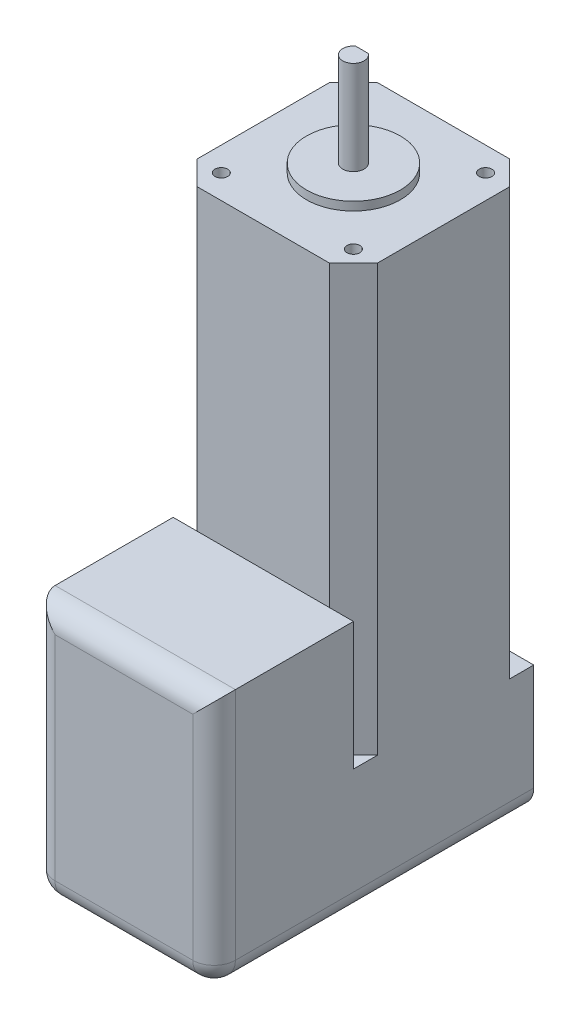
ISO-10303-21;
HEADER;
FILE_DESCRIPTION(('STEP AP214'),'2;1');
FILE_NAME('part.step','',(''),(''),'','','');
FILE_SCHEMA(('AUTOMOTIVE_DESIGN { 1 0 10303 214 1 1 1 1 }'));
ENDSEC;
DATA;
#1=APPLICATION_CONTEXT('core data for automotive mechanical design processes');
#2=APPLICATION_PROTOCOL_DEFINITION('international standard','automotive_design',2000,#1);
#3=PRODUCT_CONTEXT('',#1,'mechanical');
#4=PRODUCT('Part','Part','',(#3));
#5=PRODUCT_RELATED_PRODUCT_CATEGORY('part','',(#4));
#6=PRODUCT_DEFINITION_FORMATION('','',#4);
#7=PRODUCT_DEFINITION_CONTEXT('part definition',#1,'design');
#8=PRODUCT_DEFINITION('design','',#6,#7);
#9=PRODUCT_DEFINITION_SHAPE('','',#8);
#10=(LENGTH_UNIT() NAMED_UNIT(*) SI_UNIT(.MILLI.,.METRE.));
#11=(NAMED_UNIT(*) PLANE_ANGLE_UNIT() SI_UNIT($,.RADIAN.));
#12=(NAMED_UNIT(*) SI_UNIT($,.STERADIAN.) SOLID_ANGLE_UNIT());
#13=UNCERTAINTY_MEASURE_WITH_UNIT(LENGTH_MEASURE(1.E-05),#10,'distance_accuracy_value','');
#14=(GEOMETRIC_REPRESENTATION_CONTEXT(3) GLOBAL_UNCERTAINTY_ASSIGNED_CONTEXT((#13)) GLOBAL_UNIT_ASSIGNED_CONTEXT((#10,
#11,#12)) REPRESENTATION_CONTEXT('',''));
#15=CARTESIAN_POINT('',(0.,0.,0.));
#16=DIRECTION('',(0.,0.,1.));
#17=DIRECTION('',(1.,0.,0.));
#18=AXIS2_PLACEMENT_3D('',#15,#16,#17);
#19=CARTESIAN_POINT('',(5.65,15.,0.));
#20=DIRECTION('',(0.,0.,-1.));
#21=DIRECTION('',(-1.,0.,0.));
#22=AXIS2_PLACEMENT_3D('',#19,#20,#21);
#23=PLANE('',#22);
#24=DIRECTION('',(-1.,0.,0.));
#25=VECTOR('',#24,1.);
#26=CARTESIAN_POINT('',(0.,-55.,0.));
#27=LINE('',#26,#25);
#28=CARTESIAN_POINT('',(36.65,-55.,0.));
#29=VERTEX_POINT('',#28);
#30=CARTESIAN_POINT('',(5.65,-55.,0.));
#31=VERTEX_POINT('',#30);
#32=EDGE_CURVE('E213',#29,#31,#27,.T.);
#33=ORIENTED_EDGE('',*,*,#32,.F.);
#34=DIRECTION('',(0.,-1.,0.));
#35=VECTOR('',#34,1.);
#36=CARTESIAN_POINT('',(36.65,15.,0.));
#37=LINE('',#36,#35);
#38=CARTESIAN_POINT('',(36.65,15.,0.));
#39=VERTEX_POINT('',#38);
#40=EDGE_CURVE('E380',#39,#29,#37,.T.);
#41=ORIENTED_EDGE('',*,*,#40,.F.);
#42=DIRECTION('',(1.,0.,0.));
#43=VECTOR('',#42,1.);
#44=CARTESIAN_POINT('',(5.65,15.,0.));
#45=LINE('',#44,#43);
#46=CARTESIAN_POINT('',(5.65,15.,0.));
#47=VERTEX_POINT('',#46);
#48=EDGE_CURVE('E353',#47,#39,#45,.T.);
#49=ORIENTED_EDGE('',*,*,#48,.F.);
#50=DIRECTION('',(0.,-1.,0.));
#51=VECTOR('',#50,1.);
#52=CARTESIAN_POINT('',(5.65,15.,0.));
#53=LINE('',#52,#51);
#54=EDGE_CURVE('E384',#47,#31,#53,.T.);
#55=ORIENTED_EDGE('',*,*,#54,.T.);
#56=EDGE_LOOP('',(#33,#41,#49,#55));
#57=FACE_BOUND('',#56,.T.);
#58=ADVANCED_FACE('F41',(#57),#23,.F.);
#59=CARTESIAN_POINT('',(0.,-85.,0.));
#60=DIRECTION('',(0.,1.,0.));
#61=DIRECTION('',(0.,0.,1.));
#62=AXIS2_PLACEMENT_3D('',#59,#60,#61);
#63=PLANE('',#62);
#64=DIRECTION('',(0.,0.,-1.));
#65=VECTOR('',#64,1.);
#66=CARTESIAN_POINT('',(0.,-85.,32.7));
#67=LINE('',#66,#65);
#68=CARTESIAN_POINT('',(0.,-85.,0.));
#69=VERTEX_POINT('',#68);
#70=CARTESIAN_POINT('',(0.,-85.,-5.65));
#71=VERTEX_POINT('',#70);
#72=EDGE_CURVE('E253',#69,#71,#67,.T.);
#73=ORIENTED_EDGE('',*,*,#72,.F.);
#74=DIRECTION('',(1.,0.,0.));
#75=VECTOR('',#74,1.);
#76=CARTESIAN_POINT('',(0.,-85.,0.));
#77=LINE('',#76,#75);
#78=CARTESIAN_POINT('',(5.65,-85.,0.));
#79=VERTEX_POINT('',#78);
#80=EDGE_CURVE('E226',#69,#79,#77,.T.);
#81=ORIENTED_EDGE('',*,*,#80,.T.);
#82=DIRECTION('',(-0.707106781186548,0.,-0.707106781186547));
#83=VECTOR('',#82,1.);
#84=CARTESIAN_POINT('',(5.65,-85.,0.));
#85=LINE('',#84,#83);
#86=EDGE_CURVE('E295',#79,#71,#85,.T.);
#87=ORIENTED_EDGE('',*,*,#86,.T.);
#88=EDGE_LOOP('',(#73,#81,#87));
#89=FACE_BOUND('',#88,.T.);
#90=ADVANCED_FACE('F532',(#89),#63,.T.);
#91=DIRECTION('',(-0.707106781186547,0.,0.707106781186548));
#92=VECTOR('',#91,1.);
#93=CARTESIAN_POINT('',(42.3,-85.,-5.65));
#94=LINE('',#93,#92);
#95=CARTESIAN_POINT('',(42.3,-85.,-5.65));
#96=VERTEX_POINT('',#95);
#97=CARTESIAN_POINT('',(36.65,-85.,0.));
#98=VERTEX_POINT('',#97);
#99=EDGE_CURVE('E307',#96,#98,#94,.T.);
#100=ORIENTED_EDGE('',*,*,#99,.T.);
#101=DIRECTION('',(-1.,0.,0.));
#102=VECTOR('',#101,1.);
#103=CARTESIAN_POINT('',(0.,-85.,0.));
#104=LINE('',#103,#102);
#105=CARTESIAN_POINT('',(42.3,-85.,0.));
#106=VERTEX_POINT('',#105);
#107=EDGE_CURVE('E230',#106,#98,#104,.T.);
#108=ORIENTED_EDGE('',*,*,#107,.F.);
#109=DIRECTION('',(0.,0.,1.));
#110=VECTOR('',#109,1.);
#111=CARTESIAN_POINT('',(42.3,-85.,32.7));
#112=LINE('',#111,#110);
#113=EDGE_CURVE('E203',#96,#106,#112,.T.);
#114=ORIENTED_EDGE('',*,*,#113,.F.);
#115=EDGE_LOOP('',(#100,#108,#114));
#116=FACE_BOUND('',#115,.T.);
#117=ADVANCED_FACE('F529',(#116),#63,.T.);
#118=CARTESIAN_POINT('',(0.,15.,0.));
#119=DIRECTION('',(0.,-1.,0.));
#120=DIRECTION('',(0.,0.,-1.));
#121=AXIS2_PLACEMENT_3D('',#118,#119,#120);
#122=PLANE('',#121);
#123=CARTESIAN_POINT('',(21.15,15.,-21.15));
#124=DIRECTION('',(0.,-1.,0.));
#125=DIRECTION('',(0.,0.,-1.));
#126=AXIS2_PLACEMENT_3D('',#123,#124,#125);
#127=CIRCLE('',#126,11.);
#128=CARTESIAN_POINT('',(21.15,15.,-32.15));
#129=VERTEX_POINT('',#128);
#130=EDGE_CURVE('E291',#129,#129,#127,.F.);
#131=ORIENTED_EDGE('',*,*,#130,.F.);
#132=EDGE_LOOP('',(#131));
#133=FACE_BOUND('',#132,.T.);
#134=DIRECTION('',(-0.707106781186548,0.,0.707106781186547));
#135=VECTOR('',#134,1.);
#136=CARTESIAN_POINT('',(5.65,15.,-42.3));
#137=LINE('',#136,#135);
#138=CARTESIAN_POINT('',(5.65,15.,-42.3));
#139=VERTEX_POINT('',#138);
#140=CARTESIAN_POINT('',(0.,15.,-36.65));
#141=VERTEX_POINT('',#140);
#142=EDGE_CURVE('E340',#139,#141,#137,.T.);
#143=ORIENTED_EDGE('',*,*,#142,.T.);
#144=DIRECTION('',(0.,0.,1.));
#145=VECTOR('',#144,1.);
#146=CARTESIAN_POINT('',(0.,15.,-5.65));
#147=LINE('',#146,#145);
#148=CARTESIAN_POINT('',(0.,15.,-5.65));
#149=VERTEX_POINT('',#148);
#150=EDGE_CURVE('E347',#141,#149,#147,.T.);
#151=ORIENTED_EDGE('',*,*,#150,.T.);
#152=DIRECTION('',(0.707106781186548,0.,0.707106781186547));
#153=VECTOR('',#152,1.);
#154=CARTESIAN_POINT('',(5.65,15.,0.));
#155=LINE('',#154,#153);
#156=EDGE_CURVE('E350',#149,#47,#155,.T.);
#157=ORIENTED_EDGE('',*,*,#156,.T.);
#158=ORIENTED_EDGE('',*,*,#48,.T.);
#159=DIRECTION('',(0.707106781186547,0.,-0.707106781186548));
#160=VECTOR('',#159,1.);
#161=CARTESIAN_POINT('',(42.3,15.,-5.65));
#162=LINE('',#161,#160);
#163=CARTESIAN_POINT('',(42.3,15.,-5.65));
#164=VERTEX_POINT('',#163);
#165=EDGE_CURVE('E356',#39,#164,#162,.T.);
#166=ORIENTED_EDGE('',*,*,#165,.T.);
#167=DIRECTION('',(0.,0.,-1.));
#168=VECTOR('',#167,1.);
#169=CARTESIAN_POINT('',(42.3,15.,-5.65));
#170=LINE('',#169,#168);
#171=CARTESIAN_POINT('',(42.3,15.,-36.65));
#172=VERTEX_POINT('',#171);
#173=EDGE_CURVE('E359',#164,#172,#170,.T.);
#174=ORIENTED_EDGE('',*,*,#173,.T.);
#175=DIRECTION('',(-0.707106781186547,0.,-0.707106781186547));
#176=VECTOR('',#175,1.);
#177=CARTESIAN_POINT('',(36.65,15.,-42.3));
#178=LINE('',#177,#176);
#179=CARTESIAN_POINT('',(36.65,15.,-42.3));
#180=VERTEX_POINT('',#179);
#181=EDGE_CURVE('E362',#172,#180,#178,.T.);
#182=ORIENTED_EDGE('',*,*,#181,.T.);
#183=DIRECTION('',(-1.,0.,0.));
#184=VECTOR('',#183,1.);
#185=CARTESIAN_POINT('',(5.65,15.,-42.3));
#186=LINE('',#185,#184);
#187=EDGE_CURVE('E365',#180,#139,#186,.T.);
#188=ORIENTED_EDGE('',*,*,#187,.T.);
#189=EDGE_LOOP('',(#143,#151,#157,#158,#166,#174,#182,#188));
#190=FACE_BOUND('',#189,.T.);
#191=CARTESIAN_POINT('',(5.65,15.,-5.65));
#192=DIRECTION('',(0.,1.,0.));
#193=DIRECTION('',(0.,0.,1.));
#194=AXIS2_PLACEMENT_3D('',#191,#192,#193);
#195=CIRCLE('',#194,1.5);
#196=CARTESIAN_POINT('',(5.65,15.,-4.15));
#197=VERTEX_POINT('',#196);
#198=EDGE_CURVE('E336',#197,#197,#195,.T.);
#199=ORIENTED_EDGE('',*,*,#198,.F.);
#200=EDGE_LOOP('',(#199));
#201=FACE_BOUND('',#200,.T.);
#202=CARTESIAN_POINT('',(36.65,15.,-5.65));
#203=DIRECTION('',(0.,1.,0.));
#204=DIRECTION('',(0.,0.,1.));
#205=AXIS2_PLACEMENT_3D('',#202,#203,#204);
#206=CIRCLE('',#205,1.5);
#207=CARTESIAN_POINT('',(36.65,15.,-4.14999999999999));
#208=VERTEX_POINT('',#207);
#209=EDGE_CURVE('E328',#208,#208,#206,.T.);
#210=ORIENTED_EDGE('',*,*,#209,.F.);
#211=EDGE_LOOP('',(#210));
#212=FACE_BOUND('',#211,.T.);
#213=CARTESIAN_POINT('',(36.65,15.,-36.65));
#214=DIRECTION('',(0.,1.,0.));
#215=DIRECTION('',(0.,0.,1.));
#216=AXIS2_PLACEMENT_3D('',#213,#214,#215);
#217=CIRCLE('',#216,1.5);
#218=CARTESIAN_POINT('',(36.65,15.,-35.15));
#219=VERTEX_POINT('',#218);
#220=EDGE_CURVE('E320',#219,#219,#217,.T.);
#221=ORIENTED_EDGE('',*,*,#220,.F.);
#222=EDGE_LOOP('',(#221));
#223=FACE_BOUND('',#222,.T.);
#224=CARTESIAN_POINT('',(5.65,15.,-36.65));
#225=DIRECTION('',(0.,1.,0.));
#226=DIRECTION('',(0.,0.,1.));
#227=AXIS2_PLACEMENT_3D('',#224,#225,#226);
#228=CIRCLE('',#227,1.5);
#229=CARTESIAN_POINT('',(5.65,15.,-35.15));
#230=VERTEX_POINT('',#229);
#231=EDGE_CURVE('E312',#230,#230,#228,.T.);
#232=ORIENTED_EDGE('',*,*,#231,.F.);
#233=EDGE_LOOP('',(#232));
#234=FACE_BOUND('',#233,.T.);
#235=ADVANCED_FACE('F508',(#133,#190,#201,#212,#223,#234),#122,.F.);
#236=CARTESIAN_POINT('',(5.65,15.,-42.3));
#237=DIRECTION('',(0.707106781186547,0.,0.707106781186548));
#238=DIRECTION('',(0.707106781186548,0.,-0.707106781186547));
#239=AXIS2_PLACEMENT_3D('',#236,#237,#238);
#240=PLANE('',#239);
#241=DIRECTION('',(0.,-1.,0.));
#242=VECTOR('',#241,1.);
#243=CARTESIAN_POINT('',(5.65,15.,-42.3));
#244=LINE('',#243,#242);
#245=CARTESIAN_POINT('',(5.65,-85.,-42.3));
#246=VERTEX_POINT('',#245);
#247=EDGE_CURVE('E368',#139,#246,#244,.T.);
#248=ORIENTED_EDGE('',*,*,#247,.T.);
#249=DIRECTION('',(0.707106781186548,0.,-0.707106781186547));
#250=VECTOR('',#249,1.);
#251=CARTESIAN_POINT('',(0.,-85.,-36.65));
#252=LINE('',#251,#250);
#253=CARTESIAN_POINT('',(0.,-85.,-36.65));
#254=VERTEX_POINT('',#253);
#255=EDGE_CURVE('E299',#254,#246,#252,.T.);
#256=ORIENTED_EDGE('',*,*,#255,.F.);
#257=DIRECTION('',(0.,-1.,0.));
#258=VECTOR('',#257,1.);
#259=CARTESIAN_POINT('',(0.,15.,-36.65));
#260=LINE('',#259,#258);
#261=EDGE_CURVE('E392',#141,#254,#260,.T.);
#262=ORIENTED_EDGE('',*,*,#261,.F.);
#263=ORIENTED_EDGE('',*,*,#142,.F.);
#264=EDGE_LOOP('',(#248,#256,#262,#263));
#265=FACE_BOUND('',#264,.T.);
#266=ADVANCED_FACE('F506',(#265),#240,.F.);
#267=CARTESIAN_POINT('',(0.,15.,-5.65));
#268=DIRECTION('',(1.,0.,0.));
#269=DIRECTION('',(0.,0.,-1.));
#270=AXIS2_PLACEMENT_3D('',#267,#268,#269);
#271=PLANE('',#270);
#272=DIRECTION('',(0.,1.,0.));
#273=VECTOR('',#272,1.);
#274=CARTESIAN_POINT('',(0.,-115.,-42.3));
#275=LINE('',#274,#273);
#276=CARTESIAN_POINT('',(0.,-110.,-42.3));
#277=VERTEX_POINT('',#276);
#278=CARTESIAN_POINT('',(0.,-85.,-42.3));
#279=VERTEX_POINT('',#278);
#280=EDGE_CURVE('E262',#277,#279,#275,.T.);
#281=ORIENTED_EDGE('',*,*,#280,.F.);
#282=DIRECTION('',(0.,0.,-1.));
#283=VECTOR('',#282,1.);
#284=CARTESIAN_POINT('',(0.,-110.,-5.65));
#285=LINE('',#284,#283);
#286=CARTESIAN_POINT('',(0.,-110.,27.7));
#287=VERTEX_POINT('',#286);
#288=EDGE_CURVE('E51',#277,#287,#285,.F.);
#289=ORIENTED_EDGE('',*,*,#288,.T.);
#290=DIRECTION('',(0.,1.,0.));
#291=VECTOR('',#290,1.);
#292=CARTESIAN_POINT('',(0.,15.,27.7));
#293=LINE('',#292,#291);
#294=CARTESIAN_POINT('',(0.,-55.,27.7));
#295=VERTEX_POINT('',#294);
#296=EDGE_CURVE('E62',#287,#295,#293,.T.);
#297=ORIENTED_EDGE('',*,*,#296,.T.);
#298=DIRECTION('',(0.,0.,1.));
#299=VECTOR('',#298,1.);
#300=CARTESIAN_POINT('',(0.,-55.,32.7));
#301=LINE('',#300,#299);
#302=CARTESIAN_POINT('',(0.,-55.,0.));
#303=VERTEX_POINT('',#302);
#304=EDGE_CURVE('E197',#303,#295,#301,.T.);
#305=ORIENTED_EDGE('',*,*,#304,.F.);
#306=DIRECTION('',(0.,-1.,0.));
#307=VECTOR('',#306,1.);
#308=CARTESIAN_POINT('',(0.,-55.,0.));
#309=LINE('',#308,#307);
#310=EDGE_CURVE('E208',#303,#69,#309,.T.);
#311=ORIENTED_EDGE('',*,*,#310,.T.);
#312=ORIENTED_EDGE('',*,*,#72,.T.);
#313=DIRECTION('',(0.,-1.,0.));
#314=VECTOR('',#313,1.);
#315=CARTESIAN_POINT('',(0.,15.,-5.65));
#316=LINE('',#315,#314);
#317=EDGE_CURVE('E388',#149,#71,#316,.T.);
#318=ORIENTED_EDGE('',*,*,#317,.F.);
#319=ORIENTED_EDGE('',*,*,#150,.F.);
#320=ORIENTED_EDGE('',*,*,#261,.T.);
#321=EDGE_CURVE('E252',#254,#279,#67,.T.);
#322=ORIENTED_EDGE('',*,*,#321,.T.);
#323=EDGE_LOOP('',(#281,#289,#297,#305,#311,#312,#318,#319,#320,#322));
#324=FACE_BOUND('',#323,.T.);
#325=ADVANCED_FACE('F228',(#324),#271,.F.);
#326=CARTESIAN_POINT('',(5.65,15.,0.));
#327=DIRECTION('',(0.707106781186547,0.,-0.707106781186548));
#328=DIRECTION('',(-0.707106781186548,0.,-0.707106781186547));
#329=AXIS2_PLACEMENT_3D('',#326,#327,#328);
#330=PLANE('',#329);
#331=ORIENTED_EDGE('',*,*,#317,.T.);
#332=ORIENTED_EDGE('',*,*,#86,.F.);
#333=DIRECTION('',(0.,-1.,0.));
#334=VECTOR('',#333,1.);
#335=CARTESIAN_POINT('',(5.65,15.,0.));
#336=LINE('',#335,#334);
#337=EDGE_CURVE('E239',#31,#79,#336,.T.);
#338=ORIENTED_EDGE('',*,*,#337,.F.);
#339=ORIENTED_EDGE('',*,*,#54,.F.);
#340=ORIENTED_EDGE('',*,*,#156,.F.);
#341=EDGE_LOOP('',(#331,#332,#338,#339,#340));
#342=FACE_BOUND('',#341,.T.);
#343=ADVANCED_FACE('F553',(#342),#330,.F.);
#344=CARTESIAN_POINT('',(42.3,15.,-5.65));
#345=DIRECTION('',(-0.707106781186548,0.,-0.707106781186547));
#346=DIRECTION('',(-0.707106781186547,0.,0.707106781186548));
#347=AXIS2_PLACEMENT_3D('',#344,#345,#346);
#348=PLANE('',#347);
#349=ORIENTED_EDGE('',*,*,#40,.T.);
#350=DIRECTION('',(0.,1.,0.));
#351=VECTOR('',#350,1.);
#352=CARTESIAN_POINT('',(36.65,15.,0.));
#353=LINE('',#352,#351);
#354=EDGE_CURVE('E207',#98,#29,#353,.T.);
#355=ORIENTED_EDGE('',*,*,#354,.F.);
#356=ORIENTED_EDGE('',*,*,#99,.F.);
#357=DIRECTION('',(0.,-1.,0.));
#358=VECTOR('',#357,1.);
#359=CARTESIAN_POINT('',(42.3,15.,-5.65));
#360=LINE('',#359,#358);
#361=EDGE_CURVE('E377',#164,#96,#360,.T.);
#362=ORIENTED_EDGE('',*,*,#361,.F.);
#363=ORIENTED_EDGE('',*,*,#165,.F.);
#364=EDGE_LOOP('',(#349,#355,#356,#362,#363));
#365=FACE_BOUND('',#364,.T.);
#366=ADVANCED_FACE('F527',(#365),#348,.F.);
#367=CARTESIAN_POINT('',(42.3,15.,-5.65));
#368=DIRECTION('',(-1.,0.,0.));
#369=DIRECTION('',(0.,0.,1.));
#370=AXIS2_PLACEMENT_3D('',#367,#368,#369);
#371=PLANE('',#370);
#372=DIRECTION('',(0.,1.,0.));
#373=VECTOR('',#372,1.);
#374=CARTESIAN_POINT('',(42.3,15.,27.7));
#375=LINE('',#374,#373);
#376=CARTESIAN_POINT('',(42.3,-55.,27.7));
#377=VERTEX_POINT('',#376);
#378=CARTESIAN_POINT('',(42.3,-110.,27.7));
#379=VERTEX_POINT('',#378);
#380=EDGE_CURVE('E423',#377,#379,#375,.F.);
#381=ORIENTED_EDGE('',*,*,#380,.T.);
#382=DIRECTION('',(0.,0.,1.));
#383=VECTOR('',#382,1.);
#384=CARTESIAN_POINT('',(42.3,-110.,-5.65));
#385=LINE('',#384,#383);
#386=CARTESIAN_POINT('',(42.3,-110.,-42.3));
#387=VERTEX_POINT('',#386);
#388=EDGE_CURVE('E426',#379,#387,#385,.F.);
#389=ORIENTED_EDGE('',*,*,#388,.T.);
#390=DIRECTION('',(0.,1.,0.));
#391=VECTOR('',#390,1.);
#392=CARTESIAN_POINT('',(42.3,-115.,-42.3));
#393=LINE('',#392,#391);
#394=CARTESIAN_POINT('',(42.3,-85.,-42.3));
#395=VERTEX_POINT('',#394);
#396=EDGE_CURVE('E246',#387,#395,#393,.T.);
#397=ORIENTED_EDGE('',*,*,#396,.T.);
#398=CARTESIAN_POINT('',(42.3,-85.,-36.65));
#399=VERTEX_POINT('',#398);
#400=EDGE_CURVE('E248',#395,#399,#112,.T.);
#401=ORIENTED_EDGE('',*,*,#400,.T.);
#402=DIRECTION('',(0.,-1.,0.));
#403=VECTOR('',#402,1.);
#404=CARTESIAN_POINT('',(42.3,15.,-36.65));
#405=LINE('',#404,#403);
#406=EDGE_CURVE('E374',#172,#399,#405,.T.);
#407=ORIENTED_EDGE('',*,*,#406,.F.);
#408=ORIENTED_EDGE('',*,*,#173,.F.);
#409=ORIENTED_EDGE('',*,*,#361,.T.);
#410=ORIENTED_EDGE('',*,*,#113,.T.);
#411=DIRECTION('',(0.,-1.,0.));
#412=VECTOR('',#411,1.);
#413=CARTESIAN_POINT('',(42.3,-55.,0.));
#414=LINE('',#413,#412);
#415=CARTESIAN_POINT('',(42.3,-55.,0.));
#416=VERTEX_POINT('',#415);
#417=EDGE_CURVE('E200',#416,#106,#414,.T.);
#418=ORIENTED_EDGE('',*,*,#417,.F.);
#419=DIRECTION('',(0.,0.,-1.));
#420=VECTOR('',#419,1.);
#421=CARTESIAN_POINT('',(42.3,-55.,32.7));
#422=LINE('',#421,#420);
#423=EDGE_CURVE('E185',#377,#416,#422,.T.);
#424=ORIENTED_EDGE('',*,*,#423,.F.);
#425=EDGE_LOOP('',(#381,#389,#397,#401,#407,#408,#409,#410,#418,#424));
#426=FACE_BOUND('',#425,.T.);
#427=ADVANCED_FACE('F201',(#426),#371,.F.);
#428=CARTESIAN_POINT('',(36.65,15.,-42.3));
#429=DIRECTION('',(-0.707106781186547,0.,0.707106781186547));
#430=DIRECTION('',(0.707106781186548,0.,0.707106781186548));
#431=AXIS2_PLACEMENT_3D('',#428,#429,#430);
#432=PLANE('',#431);
#433=ORIENTED_EDGE('',*,*,#406,.T.);
#434=DIRECTION('',(0.707106781186547,0.,0.707106781186547));
#435=VECTOR('',#434,1.);
#436=CARTESIAN_POINT('',(36.65,-85.,-42.3));
#437=LINE('',#436,#435);
#438=CARTESIAN_POINT('',(36.65,-85.,-42.3));
#439=VERTEX_POINT('',#438);
#440=EDGE_CURVE('E303',#439,#399,#437,.T.);
#441=ORIENTED_EDGE('',*,*,#440,.F.);
#442=DIRECTION('',(0.,-1.,0.));
#443=VECTOR('',#442,1.);
#444=CARTESIAN_POINT('',(36.65,15.,-42.3));
#445=LINE('',#444,#443);
#446=EDGE_CURVE('E371',#180,#439,#445,.T.);
#447=ORIENTED_EDGE('',*,*,#446,.F.);
#448=ORIENTED_EDGE('',*,*,#181,.F.);
#449=EDGE_LOOP('',(#433,#441,#447,#448));
#450=FACE_BOUND('',#449,.T.);
#451=ADVANCED_FACE('F517',(#450),#432,.F.);
#452=CARTESIAN_POINT('',(5.65,15.,-42.3));
#453=DIRECTION('',(0.,0.,1.));
#454=DIRECTION('',(1.,0.,0.));
#455=AXIS2_PLACEMENT_3D('',#452,#453,#454);
#456=PLANE('',#455);
#457=ORIENTED_EDGE('',*,*,#396,.F.);
#458=CARTESIAN_POINT('',(37.3,-110.,-42.3));
#459=DIRECTION('',(0.,0.,1.));
#460=DIRECTION('',(1.,0.,0.));
#461=AXIS2_PLACEMENT_3D('',#458,#459,#460);
#462=CIRCLE('',#461,5.);
#463=CARTESIAN_POINT('',(37.3,-115.,-42.3));
#464=VERTEX_POINT('',#463);
#465=EDGE_CURVE('E432',#387,#464,#462,.F.);
#466=ORIENTED_EDGE('',*,*,#465,.T.);
#467=DIRECTION('',(1.,0.,0.));
#468=VECTOR('',#467,1.);
#469=CARTESIAN_POINT('',(42.3,-115.,-42.3));
#470=LINE('',#469,#468);
#471=CARTESIAN_POINT('',(5.,-115.,-42.3));
#472=VERTEX_POINT('',#471);
#473=EDGE_CURVE('E242',#472,#464,#470,.T.);
#474=ORIENTED_EDGE('',*,*,#473,.F.);
#475=CARTESIAN_POINT('',(5.,-110.,-42.3));
#476=DIRECTION('',(0.,0.,1.));
#477=DIRECTION('',(1.,0.,0.));
#478=AXIS2_PLACEMENT_3D('',#475,#476,#477);
#479=CIRCLE('',#478,5.);
#480=EDGE_CURVE('E429',#472,#277,#479,.F.);
#481=ORIENTED_EDGE('',*,*,#480,.T.);
#482=ORIENTED_EDGE('',*,*,#280,.T.);
#483=DIRECTION('',(1.,0.,0.));
#484=VECTOR('',#483,1.);
#485=CARTESIAN_POINT('',(42.3,-85.,-42.3));
#486=LINE('',#485,#484);
#487=EDGE_CURVE('E247',#279,#246,#486,.T.);
#488=ORIENTED_EDGE('',*,*,#487,.T.);
#489=ORIENTED_EDGE('',*,*,#247,.F.);
#490=ORIENTED_EDGE('',*,*,#187,.F.);
#491=ORIENTED_EDGE('',*,*,#446,.T.);
#492=EDGE_CURVE('E256',#439,#395,#486,.T.);
#493=ORIENTED_EDGE('',*,*,#492,.T.);
#494=EDGE_LOOP('',(#457,#466,#474,#481,#482,#488,#489,#490,#491,#493));
#495=FACE_BOUND('',#494,.T.);
#496=ADVANCED_FACE('F485',(#495),#456,.F.);
#497=CARTESIAN_POINT('',(5.65,15.,-5.65));
#498=DIRECTION('',(0.,-1.,0.));
#499=DIRECTION('',(0.,0.,-1.));
#500=AXIS2_PLACEMENT_3D('',#497,#498,#499);
#501=CYLINDRICAL_SURFACE('',#500,1.5);
#502=ORIENTED_EDGE('',*,*,#198,.T.);
#503=EDGE_LOOP('',(#502));
#504=FACE_BOUND('',#503,.T.);
#505=CARTESIAN_POINT('',(5.65,0.,-5.65));
#506=DIRECTION('',(0.,1.,0.));
#507=DIRECTION('',(0.,0.,1.));
#508=AXIS2_PLACEMENT_3D('',#505,#506,#507);
#509=CIRCLE('',#508,1.5);
#510=CARTESIAN_POINT('',(5.65,0.,-4.15));
#511=VERTEX_POINT('',#510);
#512=EDGE_CURVE('E332',#511,#511,#509,.T.);
#513=ORIENTED_EDGE('',*,*,#512,.F.);
#514=EDGE_LOOP('',(#513));
#515=FACE_BOUND('',#514,.T.);
#516=ADVANCED_FACE('F641',(#504,#515),#501,.F.);
#517=CARTESIAN_POINT('',(36.65,15.,-5.65));
#518=DIRECTION('',(0.,-1.,0.));
#519=DIRECTION('',(0.,0.,-1.));
#520=AXIS2_PLACEMENT_3D('',#517,#518,#519);
#521=CYLINDRICAL_SURFACE('',#520,1.5);
#522=ORIENTED_EDGE('',*,*,#209,.T.);
#523=EDGE_LOOP('',(#522));
#524=FACE_BOUND('',#523,.T.);
#525=CARTESIAN_POINT('',(36.65,0.,-5.65));
#526=DIRECTION('',(0.,1.,0.));
#527=DIRECTION('',(0.,0.,1.));
#528=AXIS2_PLACEMENT_3D('',#525,#526,#527);
#529=CIRCLE('',#528,1.5);
#530=CARTESIAN_POINT('',(36.65,0.,-4.14999999999999));
#531=VERTEX_POINT('',#530);
#532=EDGE_CURVE('E324',#531,#531,#529,.T.);
#533=ORIENTED_EDGE('',*,*,#532,.F.);
#534=EDGE_LOOP('',(#533));
#535=FACE_BOUND('',#534,.T.);
#536=ADVANCED_FACE('F637',(#524,#535),#521,.F.);
#537=CARTESIAN_POINT('',(36.65,15.,-36.65));
#538=DIRECTION('',(0.,-1.,0.));
#539=DIRECTION('',(0.,0.,-1.));
#540=AXIS2_PLACEMENT_3D('',#537,#538,#539);
#541=CYLINDRICAL_SURFACE('',#540,1.5);
#542=ORIENTED_EDGE('',*,*,#220,.T.);
#543=EDGE_LOOP('',(#542));
#544=FACE_BOUND('',#543,.T.);
#545=CARTESIAN_POINT('',(36.65,0.,-36.65));
#546=DIRECTION('',(0.,1.,0.));
#547=DIRECTION('',(0.,0.,1.));
#548=AXIS2_PLACEMENT_3D('',#545,#546,#547);
#549=CIRCLE('',#548,1.5);
#550=CARTESIAN_POINT('',(36.65,0.,-35.15));
#551=VERTEX_POINT('',#550);
#552=EDGE_CURVE('E316',#551,#551,#549,.T.);
#553=ORIENTED_EDGE('',*,*,#552,.F.);
#554=EDGE_LOOP('',(#553));
#555=FACE_BOUND('',#554,.T.);
#556=ADVANCED_FACE('F633',(#544,#555),#541,.F.);
#557=CARTESIAN_POINT('',(5.65,15.,-36.65));
#558=DIRECTION('',(0.,-1.,0.));
#559=DIRECTION('',(0.,0.,-1.));
#560=AXIS2_PLACEMENT_3D('',#557,#558,#559);
#561=CYLINDRICAL_SURFACE('',#560,1.5);
#562=ORIENTED_EDGE('',*,*,#231,.T.);
#563=EDGE_LOOP('',(#562));
#564=FACE_BOUND('',#563,.T.);
#565=CARTESIAN_POINT('',(5.65,0.,-36.65));
#566=DIRECTION('',(0.,1.,0.));
#567=DIRECTION('',(0.,0.,1.));
#568=AXIS2_PLACEMENT_3D('',#565,#566,#567);
#569=CIRCLE('',#568,1.5);
#570=CARTESIAN_POINT('',(5.65,0.,-35.15));
#571=VERTEX_POINT('',#570);
#572=EDGE_CURVE('E311',#571,#571,#569,.T.);
#573=ORIENTED_EDGE('',*,*,#572,.F.);
#574=EDGE_LOOP('',(#573));
#575=FACE_BOUND('',#574,.T.);
#576=ADVANCED_FACE('F630',(#564,#575),#561,.F.);
#577=CARTESIAN_POINT('',(0.,0.,0.));
#578=DIRECTION('',(0.,-1.,0.));
#579=DIRECTION('',(0.,0.,-1.));
#580=AXIS2_PLACEMENT_3D('',#577,#578,#579);
#581=PLANE('',#580);
#582=ORIENTED_EDGE('',*,*,#572,.T.);
#583=EDGE_LOOP('',(#582));
#584=FACE_BOUND('',#583,.T.);
#585=ADVANCED_FACE('F629',(#584),#581,.F.);
#586=ORIENTED_EDGE('',*,*,#532,.T.);
#587=EDGE_LOOP('',(#586));
#588=FACE_BOUND('',#587,.T.);
#589=ADVANCED_FACE('F856',(#588),#581,.F.);
#590=ORIENTED_EDGE('',*,*,#512,.T.);
#591=EDGE_LOOP('',(#590));
#592=FACE_BOUND('',#591,.T.);
#593=ADVANCED_FACE('F627',(#592),#581,.F.);
#594=ORIENTED_EDGE('',*,*,#552,.T.);
#595=EDGE_LOOP('',(#594));
#596=FACE_BOUND('',#595,.T.);
#597=ADVANCED_FACE('F623',(#596),#581,.F.);
#598=CARTESIAN_POINT('',(21.15,17.,-21.15));
#599=DIRECTION('',(0.,-1.,0.));
#600=DIRECTION('',(0.,0.,-1.));
#601=AXIS2_PLACEMENT_3D('',#598,#599,#600);
#602=CYLINDRICAL_SURFACE('',#601,11.);
#603=CARTESIAN_POINT('',(21.15,17.,-21.15));
#604=DIRECTION('',(0.,1.,0.));
#605=DIRECTION('',(0.,0.,1.));
#606=AXIS2_PLACEMENT_3D('',#603,#604,#605);
#607=CIRCLE('',#606,11.);
#608=CARTESIAN_POINT('',(21.15,17.,-10.15));
#609=VERTEX_POINT('',#608);
#610=EDGE_CURVE('E286',#609,#609,#607,.T.);
#611=ORIENTED_EDGE('',*,*,#610,.F.);
#612=EDGE_LOOP('',(#611));
#613=FACE_BOUND('',#612,.T.);
#614=ORIENTED_EDGE('',*,*,#130,.T.);
#615=EDGE_LOOP('',(#614));
#616=FACE_BOUND('',#615,.T.);
#617=ADVANCED_FACE('F619',(#613,#616),#602,.T.);
#618=CARTESIAN_POINT('',(21.15,17.,-21.15));
#619=DIRECTION('',(0.,1.,0.));
#620=DIRECTION('',(0.,0.,1.));
#621=AXIS2_PLACEMENT_3D('',#618,#619,#620);
#622=PLANE('',#621);
#623=CARTESIAN_POINT('',(21.15,17.,-21.15));
#624=DIRECTION('',(0.,1.,0.));
#625=DIRECTION('',(0.,0.,1.));
#626=AXIS2_PLACEMENT_3D('',#623,#624,#625);
#627=CIRCLE('',#626,2.5);
#628=CARTESIAN_POINT('',(21.15,17.,-18.65));
#629=VERTEX_POINT('',#628);
#630=EDGE_CURVE('E287',#629,#629,#627,.T.);
#631=ORIENTED_EDGE('',*,*,#630,.F.);
#632=EDGE_LOOP('',(#631));
#633=FACE_BOUND('',#632,.T.);
#634=ORIENTED_EDGE('',*,*,#610,.T.);
#635=EDGE_LOOP('',(#634));
#636=FACE_BOUND('',#635,.T.);
#637=ADVANCED_FACE('F615',(#633,#636),#622,.T.);
#638=CARTESIAN_POINT('',(21.15,39.,-21.15));
#639=DIRECTION('',(0.,-1.,0.));
#640=DIRECTION('',(0.,0.,-1.));
#641=AXIS2_PLACEMENT_3D('',#638,#639,#640);
#642=CYLINDRICAL_SURFACE('',#641,2.5);
#643=CARTESIAN_POINT('',(21.15,39.,-21.15));
#644=DIRECTION('',(0.,1.,0.));
#645=DIRECTION('',(0.,0.,1.));
#646=AXIS2_PLACEMENT_3D('',#643,#644,#645);
#647=CIRCLE('',#646,2.5);
#648=CARTESIAN_POINT('',(19.65,39.,-23.15));
#649=VERTEX_POINT('',#648);
#650=CARTESIAN_POINT('',(22.65,39.,-23.15));
#651=VERTEX_POINT('',#650);
#652=EDGE_CURVE('E280',#649,#651,#647,.T.);
#653=ORIENTED_EDGE('',*,*,#652,.F.);
#654=DIRECTION('',(0.,1.,0.));
#655=VECTOR('',#654,1.);
#656=CARTESIAN_POINT('',(19.65,24.,-23.15));
#657=LINE('',#656,#655);
#658=CARTESIAN_POINT('',(19.65,24.,-23.15));
#659=VERTEX_POINT('',#658);
#660=EDGE_CURVE('E273',#659,#649,#657,.T.);
#661=ORIENTED_EDGE('',*,*,#660,.F.);
#662=CARTESIAN_POINT('',(21.15,24.,-21.15));
#663=DIRECTION('',(0.,1.,0.));
#664=DIRECTION('',(0.,0.,-1.));
#665=AXIS2_PLACEMENT_3D('',#662,#663,#664);
#666=CIRCLE('',#665,2.5);
#667=CARTESIAN_POINT('',(22.65,24.,-23.15));
#668=VERTEX_POINT('',#667);
#669=EDGE_CURVE('E266',#668,#659,#666,.T.);
#670=ORIENTED_EDGE('',*,*,#669,.F.);
#671=DIRECTION('',(0.,1.,0.));
#672=VECTOR('',#671,1.);
#673=CARTESIAN_POINT('',(22.65,24.,-23.15));
#674=LINE('',#673,#672);
#675=EDGE_CURVE('E276',#668,#651,#674,.T.);
#676=ORIENTED_EDGE('',*,*,#675,.T.);
#677=EDGE_LOOP('',(#653,#661,#670,#676));
#678=FACE_BOUND('',#677,.T.);
#679=ORIENTED_EDGE('',*,*,#630,.T.);
#680=EDGE_LOOP('',(#679));
#681=FACE_BOUND('',#680,.T.);
#682=ADVANCED_FACE('F611',(#678,#681),#642,.T.);
#683=CARTESIAN_POINT('',(21.15,39.,-21.15));
#684=DIRECTION('',(0.,1.,0.));
#685=DIRECTION('',(0.,0.,1.));
#686=AXIS2_PLACEMENT_3D('',#683,#684,#685);
#687=PLANE('',#686);
#688=DIRECTION('',(1.,0.,0.));
#689=VECTOR('',#688,1.);
#690=CARTESIAN_POINT('',(19.65,39.,-23.15));
#691=LINE('',#690,#689);
#692=EDGE_CURVE('E265',#649,#651,#691,.T.);
#693=ORIENTED_EDGE('',*,*,#692,.F.);
#694=ORIENTED_EDGE('',*,*,#652,.T.);
#695=EDGE_LOOP('',(#693,#694));
#696=FACE_BOUND('',#695,.T.);
#697=ADVANCED_FACE('F607',(#696),#687,.T.);
#698=CARTESIAN_POINT('',(19.65,24.,-23.15));
#699=DIRECTION('',(0.,0.,1.));
#700=DIRECTION('',(1.,0.,0.));
#701=AXIS2_PLACEMENT_3D('',#698,#699,#700);
#702=PLANE('',#701);
#703=ORIENTED_EDGE('',*,*,#692,.T.);
#704=ORIENTED_EDGE('',*,*,#675,.F.);
#705=DIRECTION('',(1.,0.,0.));
#706=VECTOR('',#705,1.);
#707=CARTESIAN_POINT('',(19.65,24.,-23.15));
#708=LINE('',#707,#706);
#709=EDGE_CURVE('E269',#659,#668,#708,.T.);
#710=ORIENTED_EDGE('',*,*,#709,.F.);
#711=ORIENTED_EDGE('',*,*,#660,.T.);
#712=EDGE_LOOP('',(#703,#704,#710,#711));
#713=FACE_BOUND('',#712,.T.);
#714=ADVANCED_FACE('F603',(#713),#702,.F.);
#715=CARTESIAN_POINT('',(21.15,24.,-21.15));
#716=DIRECTION('',(0.,-1.,0.));
#717=DIRECTION('',(0.,0.,-1.));
#718=AXIS2_PLACEMENT_3D('',#715,#716,#717);
#719=PLANE('',#718);
#720=ORIENTED_EDGE('',*,*,#669,.T.);
#721=ORIENTED_EDGE('',*,*,#709,.T.);
#722=EDGE_LOOP('',(#720,#721));
#723=FACE_BOUND('',#722,.T.);
#724=ADVANCED_FACE('F544',(#723),#719,.F.);
#725=ORIENTED_EDGE('',*,*,#321,.F.);
#726=ORIENTED_EDGE('',*,*,#255,.T.);
#727=ORIENTED_EDGE('',*,*,#487,.F.);
#728=EDGE_LOOP('',(#725,#726,#727));
#729=FACE_BOUND('',#728,.T.);
#730=ADVANCED_FACE('F501',(#729),#63,.T.);
#731=ORIENTED_EDGE('',*,*,#492,.F.);
#732=ORIENTED_EDGE('',*,*,#440,.T.);
#733=ORIENTED_EDGE('',*,*,#400,.F.);
#734=EDGE_LOOP('',(#731,#732,#733));
#735=FACE_BOUND('',#734,.T.);
#736=ADVANCED_FACE('F522',(#735),#63,.T.);
#737=CARTESIAN_POINT('',(42.3,-115.,32.7));
#738=DIRECTION('',(0.,0.,-1.));
#739=DIRECTION('',(-1.,0.,0.));
#740=AXIS2_PLACEMENT_3D('',#737,#738,#739);
#741=PLANE('',#740);
#742=DIRECTION('',(0.,1.,0.));
#743=VECTOR('',#742,1.);
#744=CARTESIAN_POINT('',(5.,-115.,32.7));
#745=LINE('',#744,#743);
#746=CARTESIAN_POINT('',(5.,-60.,32.7));
#747=VERTEX_POINT('',#746);
#748=CARTESIAN_POINT('',(5.,-110.,32.7));
#749=VERTEX_POINT('',#748);
#750=EDGE_CURVE('E416',#747,#749,#745,.F.);
#751=ORIENTED_EDGE('',*,*,#750,.T.);
#752=DIRECTION('',(-1.,0.,0.));
#753=VECTOR('',#752,1.);
#754=CARTESIAN_POINT('',(42.3,-110.,32.7));
#755=LINE('',#754,#753);
#756=CARTESIAN_POINT('',(37.3,-110.,32.7));
#757=VERTEX_POINT('',#756);
#758=EDGE_CURVE('E419',#749,#757,#755,.F.);
#759=ORIENTED_EDGE('',*,*,#758,.T.);
#760=DIRECTION('',(0.,1.,0.));
#761=VECTOR('',#760,1.);
#762=CARTESIAN_POINT('',(37.3,-115.,32.7));
#763=LINE('',#762,#761);
#764=CARTESIAN_POINT('',(37.3,-60.,32.7));
#765=VERTEX_POINT('',#764);
#766=EDGE_CURVE('E410',#757,#765,#763,.T.);
#767=ORIENTED_EDGE('',*,*,#766,.T.);
#768=DIRECTION('',(1.,0.,0.));
#769=VECTOR('',#768,1.);
#770=CARTESIAN_POINT('',(42.3,-60.,32.7));
#771=LINE('',#770,#769);
#772=EDGE_CURVE('E413',#765,#747,#771,.F.);
#773=ORIENTED_EDGE('',*,*,#772,.T.);
#774=EDGE_LOOP('',(#751,#759,#767,#773));
#775=FACE_BOUND('',#774,.T.);
#776=ADVANCED_FACE('F592',(#775),#741,.F.);
#777=CARTESIAN_POINT('',(0.,-115.,0.));
#778=DIRECTION('',(0.,1.,0.));
#779=DIRECTION('',(0.,0.,1.));
#780=AXIS2_PLACEMENT_3D('',#777,#778,#779);
#781=PLANE('',#780);
#782=ORIENTED_EDGE('',*,*,#473,.T.);
#783=DIRECTION('',(0.,0.,1.));
#784=VECTOR('',#783,1.);
#785=CARTESIAN_POINT('',(37.3,-115.,0.));
#786=LINE('',#785,#784);
#787=CARTESIAN_POINT('',(37.3,-115.,27.7));
#788=VERTEX_POINT('',#787);
#789=EDGE_CURVE('E407',#464,#788,#786,.T.);
#790=ORIENTED_EDGE('',*,*,#789,.T.);
#791=DIRECTION('',(-1.,0.,0.));
#792=VECTOR('',#791,1.);
#793=CARTESIAN_POINT('',(0.,-115.,27.7));
#794=LINE('',#793,#792);
#795=CARTESIAN_POINT('',(5.,-115.,27.7));
#796=VERTEX_POINT('',#795);
#797=EDGE_CURVE('E403',#788,#796,#794,.T.);
#798=ORIENTED_EDGE('',*,*,#797,.T.);
#799=DIRECTION('',(0.,0.,-1.));
#800=VECTOR('',#799,1.);
#801=CARTESIAN_POINT('',(5.,-115.,0.));
#802=LINE('',#801,#800);
#803=EDGE_CURVE('E400',#796,#472,#802,.T.);
#804=ORIENTED_EDGE('',*,*,#803,.T.);
#805=EDGE_LOOP('',(#782,#790,#798,#804));
#806=FACE_BOUND('',#805,.T.);
#807=ADVANCED_FACE('F489',(#806),#781,.F.);
#808=CARTESIAN_POINT('',(0.,-55.,0.));
#809=DIRECTION('',(0.,0.,1.));
#810=DIRECTION('',(1.,0.,0.));
#811=AXIS2_PLACEMENT_3D('',#808,#809,#810);
#812=PLANE('',#811);
#813=EDGE_CURVE('E196',#31,#303,#27,.T.);
#814=ORIENTED_EDGE('',*,*,#813,.F.);
#815=ORIENTED_EDGE('',*,*,#337,.T.);
#816=ORIENTED_EDGE('',*,*,#80,.F.);
#817=ORIENTED_EDGE('',*,*,#310,.F.);
#818=EDGE_LOOP('',(#814,#815,#816,#817));
#819=FACE_BOUND('',#818,.T.);
#820=ADVANCED_FACE('F224',(#819),#812,.F.);
#821=ORIENTED_EDGE('',*,*,#107,.T.);
#822=ORIENTED_EDGE('',*,*,#354,.T.);
#823=EDGE_CURVE('E190',#416,#29,#27,.T.);
#824=ORIENTED_EDGE('',*,*,#823,.F.);
#825=ORIENTED_EDGE('',*,*,#417,.T.);
#826=EDGE_LOOP('',(#821,#822,#824,#825));
#827=FACE_BOUND('',#826,.T.);
#828=ADVANCED_FACE('F210',(#827),#812,.F.);
#829=CARTESIAN_POINT('',(0.,-55.,0.));
#830=DIRECTION('',(0.,-1.,0.));
#831=DIRECTION('',(0.,0.,-1.));
#832=AXIS2_PLACEMENT_3D('',#829,#830,#831);
#833=PLANE('',#832);
#834=ORIENTED_EDGE('',*,*,#304,.T.);
#835=DIRECTION('',(1.,0.,0.));
#836=VECTOR('',#835,1.);
#837=CARTESIAN_POINT('',(0.,-55.,27.7));
#838=LINE('',#837,#836);
#839=EDGE_CURVE('E11',#295,#377,#838,.T.);
#840=ORIENTED_EDGE('',*,*,#839,.T.);
#841=ORIENTED_EDGE('',*,*,#423,.T.);
#842=ORIENTED_EDGE('',*,*,#823,.T.);
#843=ORIENTED_EDGE('',*,*,#32,.T.);
#844=ORIENTED_EDGE('',*,*,#813,.T.);
#845=EDGE_LOOP('',(#834,#840,#841,#842,#843,#844));
#846=FACE_BOUND('',#845,.T.);
#847=ADVANCED_FACE('F187',(#846),#833,.F.);
#848=CARTESIAN_POINT('',(0.,-60.,27.7));
#849=DIRECTION('',(1.,0.,0.));
#850=DIRECTION('',(0.,0.,-1.));
#851=AXIS2_PLACEMENT_3D('',#848,#849,#850);
#852=CYLINDRICAL_SURFACE('',#851,5.);
#853=CARTESIAN_POINT('',(5.,-60.,27.7));
#854=DIRECTION('',(0.707106781186547,0.707106781186547,0.));
#855=DIRECTION('',(0.707106781186547,-0.707106781186547,0.));
#856=AXIS2_PLACEMENT_3D('',#853,#854,#855);
#857=ELLIPSE('',#856,7.07106781186547,5.);
#858=EDGE_CURVE('E235',#747,#295,#857,.F.);
#859=ORIENTED_EDGE('',*,*,#858,.F.);
#860=ORIENTED_EDGE('',*,*,#772,.F.);
#861=CARTESIAN_POINT('',(37.3,-60.,27.7));
#862=DIRECTION('',(-0.707106781186547,0.707106781186547,0.));
#863=DIRECTION('',(0.707106781186547,0.707106781186547,0.));
#864=AXIS2_PLACEMENT_3D('',#861,#862,#863);
#865=ELLIPSE('',#864,7.07106781186547,5.);
#866=EDGE_CURVE('E45',#377,#765,#865,.F.);
#867=ORIENTED_EDGE('',*,*,#866,.F.);
#868=ORIENTED_EDGE('',*,*,#839,.F.);
#869=EDGE_LOOP('',(#859,#860,#867,#868));
#870=FACE_BOUND('',#869,.T.);
#871=ADVANCED_FACE('F43',(#870),#852,.T.);
#872=CARTESIAN_POINT('',(37.3,-115.,27.7));
#873=DIRECTION('',(0.,1.,0.));
#874=DIRECTION('',(0.,0.,1.));
#875=AXIS2_PLACEMENT_3D('',#872,#873,#874);
#876=CYLINDRICAL_SURFACE('',#875,5.);
#877=ORIENTED_EDGE('',*,*,#866,.T.);
#878=ORIENTED_EDGE('',*,*,#766,.F.);
#879=CARTESIAN_POINT('',(37.3,-110.,27.7));
#880=DIRECTION('',(0.,-1.,0.));
#881=DIRECTION('',(0.,0.,-1.));
#882=AXIS2_PLACEMENT_3D('',#879,#880,#881);
#883=CIRCLE('',#882,5.);
#884=EDGE_CURVE('E457',#379,#757,#883,.T.);
#885=ORIENTED_EDGE('',*,*,#884,.F.);
#886=ORIENTED_EDGE('',*,*,#380,.F.);
#887=EDGE_LOOP('',(#877,#878,#885,#886));
#888=FACE_BOUND('',#887,.T.);
#889=ADVANCED_FACE('F474',(#888),#876,.T.);
#890=CARTESIAN_POINT('',(37.3,-110.,0.));
#891=DIRECTION('',(0.,0.,1.));
#892=DIRECTION('',(1.,0.,0.));
#893=AXIS2_PLACEMENT_3D('',#890,#891,#892);
#894=CYLINDRICAL_SURFACE('',#893,5.);
#895=ORIENTED_EDGE('',*,*,#465,.F.);
#896=ORIENTED_EDGE('',*,*,#388,.F.);
#897=CARTESIAN_POINT('',(37.3,-110.,27.7));
#898=DIRECTION('',(0.,0.,1.));
#899=DIRECTION('',(1.,0.,0.));
#900=AXIS2_PLACEMENT_3D('',#897,#898,#899);
#901=CIRCLE('',#900,5.);
#902=EDGE_CURVE('E453',#788,#379,#901,.T.);
#903=ORIENTED_EDGE('',*,*,#902,.F.);
#904=ORIENTED_EDGE('',*,*,#789,.F.);
#905=EDGE_LOOP('',(#895,#896,#903,#904));
#906=FACE_BOUND('',#905,.T.);
#907=ADVANCED_FACE('F480',(#906),#894,.T.);
#908=CARTESIAN_POINT('',(5.,-110.,0.));
#909=DIRECTION('',(0.,0.,-1.));
#910=DIRECTION('',(-1.,0.,0.));
#911=AXIS2_PLACEMENT_3D('',#908,#909,#910);
#912=CYLINDRICAL_SURFACE('',#911,5.);
#913=ORIENTED_EDGE('',*,*,#480,.F.);
#914=ORIENTED_EDGE('',*,*,#803,.F.);
#915=CARTESIAN_POINT('',(5.,-110.,27.7));
#916=DIRECTION('',(0.,0.,1.));
#917=DIRECTION('',(1.,0.,0.));
#918=AXIS2_PLACEMENT_3D('',#915,#916,#917);
#919=CIRCLE('',#918,5.);
#920=EDGE_CURVE('E449',#287,#796,#919,.T.);
#921=ORIENTED_EDGE('',*,*,#920,.F.);
#922=ORIENTED_EDGE('',*,*,#288,.F.);
#923=EDGE_LOOP('',(#913,#914,#921,#922));
#924=FACE_BOUND('',#923,.T.);
#925=ADVANCED_FACE('F493',(#924),#912,.T.);
#926=CARTESIAN_POINT('',(5.,15.,27.7));
#927=DIRECTION('',(0.,1.,0.));
#928=DIRECTION('',(0.,0.,1.));
#929=AXIS2_PLACEMENT_3D('',#926,#927,#928);
#930=CYLINDRICAL_SURFACE('',#929,5.);
#931=ORIENTED_EDGE('',*,*,#858,.T.);
#932=ORIENTED_EDGE('',*,*,#296,.F.);
#933=CARTESIAN_POINT('',(5.,-110.,27.7));
#934=DIRECTION('',(0.,-1.,0.));
#935=DIRECTION('',(0.,0.,-1.));
#936=AXIS2_PLACEMENT_3D('',#933,#934,#935);
#937=CIRCLE('',#936,5.);
#938=EDGE_CURVE('E445',#749,#287,#937,.T.);
#939=ORIENTED_EDGE('',*,*,#938,.F.);
#940=ORIENTED_EDGE('',*,*,#750,.F.);
#941=EDGE_LOOP('',(#931,#932,#939,#940));
#942=FACE_BOUND('',#941,.T.);
#943=ADVANCED_FACE('F465',(#942),#930,.T.);
#944=CARTESIAN_POINT('',(37.3,-110.,27.7));
#945=DIRECTION('',(1.,0.,0.));
#946=DIRECTION('',(0.,0.,-1.));
#947=AXIS2_PLACEMENT_3D('',#944,#945,#946);
#948=SPHERICAL_SURFACE('',#947,5.);
#949=ORIENTED_EDGE('',*,*,#902,.T.);
#950=ORIENTED_EDGE('',*,*,#884,.T.);
#951=CARTESIAN_POINT('',(37.3,-110.,27.7));
#952=DIRECTION('',(1.,0.,0.));
#953=DIRECTION('',(0.,0.,-1.));
#954=AXIS2_PLACEMENT_3D('',#951,#952,#953);
#955=CIRCLE('',#954,5.);
#956=EDGE_CURVE('E442',#788,#757,#955,.F.);
#957=ORIENTED_EDGE('',*,*,#956,.F.);
#958=EDGE_LOOP('',(#949,#950,#957));
#959=FACE_BOUND('',#958,.T.);
#960=ADVANCED_FACE('F568',(#959),#948,.T.);
#961=CARTESIAN_POINT('',(5.,-110.,27.7));
#962=DIRECTION('',(-1.,0.,0.));
#963=DIRECTION('',(0.,0.,1.));
#964=AXIS2_PLACEMENT_3D('',#961,#962,#963);
#965=SPHERICAL_SURFACE('',#964,5.);
#966=ORIENTED_EDGE('',*,*,#938,.T.);
#967=ORIENTED_EDGE('',*,*,#920,.T.);
#968=CARTESIAN_POINT('',(5.,-110.,27.7));
#969=DIRECTION('',(-1.,0.,0.));
#970=DIRECTION('',(0.,0.,1.));
#971=AXIS2_PLACEMENT_3D('',#968,#969,#970);
#972=CIRCLE('',#971,5.);
#973=EDGE_CURVE('E439',#749,#796,#972,.F.);
#974=ORIENTED_EDGE('',*,*,#973,.F.);
#975=EDGE_LOOP('',(#966,#967,#974));
#976=FACE_BOUND('',#975,.T.);
#977=ADVANCED_FACE('F564',(#976),#965,.T.);
#978=CARTESIAN_POINT('',(0.,-110.,27.7));
#979=DIRECTION('',(-1.,0.,0.));
#980=DIRECTION('',(0.,0.,1.));
#981=AXIS2_PLACEMENT_3D('',#978,#979,#980);
#982=CYLINDRICAL_SURFACE('',#981,5.);
#983=ORIENTED_EDGE('',*,*,#956,.T.);
#984=ORIENTED_EDGE('',*,*,#758,.F.);
#985=ORIENTED_EDGE('',*,*,#973,.T.);
#986=ORIENTED_EDGE('',*,*,#797,.F.);
#987=EDGE_LOOP('',(#983,#984,#985,#986));
#988=FACE_BOUND('',#987,.T.);
#989=ADVANCED_FACE('F561',(#988),#982,.T.);
#990=CLOSED_SHELL('',(#58,#90,#117,#235,#266,#325,#343,#366,#427,#451,#496,#516,#536,#556,#576,
#585,#589,#593,#597,#617,#637,#682,#697,#714,#724,#730,#736,#776,#807,#820,#828,#847,#871,#889,
#907,#925,#943,#960,#977,#989));
#991=MANIFOLD_SOLID_BREP('B2',#990);
#992=ADVANCED_BREP_SHAPE_REPRESENTATION('',(#18,#991),#14);
#993=SHAPE_DEFINITION_REPRESENTATION(#9,#992);
ENDSEC;
END-ISO-10303-21;
